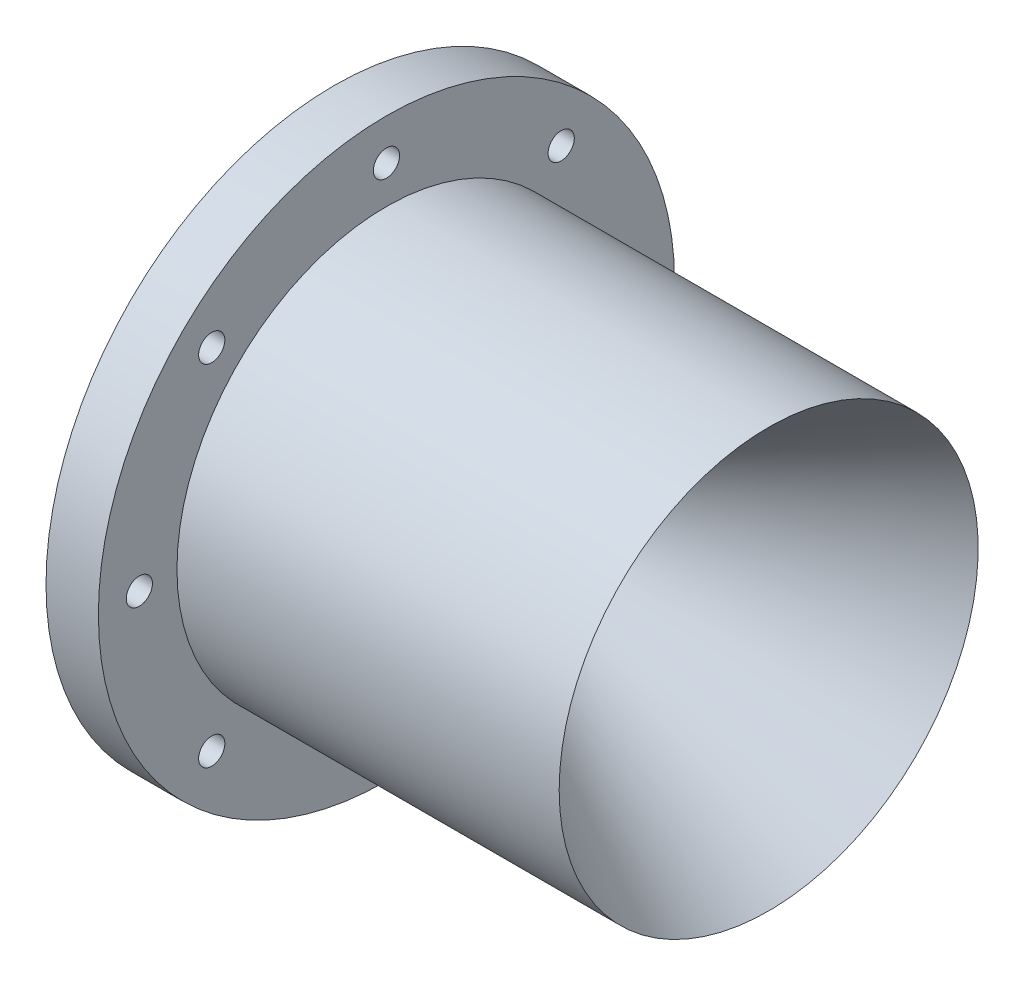
ISO-10303-21;
HEADER;
FILE_DESCRIPTION(('STEP AP214'),'2;1');
FILE_NAME('part.step','',(''),(''),'','','');
FILE_SCHEMA(('AUTOMOTIVE_DESIGN { 1 0 10303 214 1 1 1 1 }'));
ENDSEC;
DATA;
#1=APPLICATION_CONTEXT('core data for automotive mechanical design processes');
#2=APPLICATION_PROTOCOL_DEFINITION('international standard','automotive_design',2000,#1);
#3=PRODUCT_CONTEXT('',#1,'mechanical');
#4=PRODUCT('Part','Part','',(#3));
#5=PRODUCT_RELATED_PRODUCT_CATEGORY('part','',(#4));
#6=PRODUCT_DEFINITION_FORMATION('','',#4);
#7=PRODUCT_DEFINITION_CONTEXT('part definition',#1,'design');
#8=PRODUCT_DEFINITION('design','',#6,#7);
#9=PRODUCT_DEFINITION_SHAPE('','',#8);
#10=(LENGTH_UNIT() NAMED_UNIT(*) SI_UNIT(.MILLI.,.METRE.));
#11=(NAMED_UNIT(*) PLANE_ANGLE_UNIT() SI_UNIT($,.RADIAN.));
#12=(NAMED_UNIT(*) SI_UNIT($,.STERADIAN.) SOLID_ANGLE_UNIT());
#13=UNCERTAINTY_MEASURE_WITH_UNIT(LENGTH_MEASURE(1.E-05),#10,'distance_accuracy_value','');
#14=(GEOMETRIC_REPRESENTATION_CONTEXT(3) GLOBAL_UNCERTAINTY_ASSIGNED_CONTEXT((#13)) GLOBAL_UNIT_ASSIGNED_CONTEXT((#10,
#11,#12)) REPRESENTATION_CONTEXT('',''));
#15=CARTESIAN_POINT('',(0.,0.,0.));
#16=DIRECTION('',(0.,0.,1.));
#17=DIRECTION('',(1.,0.,0.));
#18=AXIS2_PLACEMENT_3D('',#15,#16,#17);
#19=CARTESIAN_POINT('',(0.,0.,0.));
#20=DIRECTION('',(-1.,0.,0.));
#21=DIRECTION('',(0.,0.,1.));
#22=AXIS2_PLACEMENT_3D('',#19,#20,#21);
#23=CYLINDRICAL_SURFACE('',#22,7.9375);
#24=CARTESIAN_POINT('',(0.,0.,0.));
#25=DIRECTION('',(-1.,0.,0.));
#26=DIRECTION('',(0.,0.,1.));
#27=AXIS2_PLACEMENT_3D('',#24,#25,#26);
#28=CIRCLE('',#27,7.9375);
#29=CARTESIAN_POINT('',(0.,0.,7.9375));
#30=VERTEX_POINT('',#29);
#31=EDGE_CURVE('E10',#30,#30,#28,.T.);
#32=ORIENTED_EDGE('',*,*,#31,.F.);
#33=EDGE_LOOP('',(#32));
#34=FACE_BOUND('',#33,.T.);
#35=CARTESIAN_POINT('',(-12.7,0.,0.));
#36=DIRECTION('',(-1.,0.,0.));
#37=DIRECTION('',(0.,0.,1.));
#38=AXIS2_PLACEMENT_3D('',#35,#36,#37);
#39=CIRCLE('',#38,7.9375);
#40=CARTESIAN_POINT('',(-12.7,0.,7.9375));
#41=VERTEX_POINT('',#40);
#42=EDGE_CURVE('E57',#41,#41,#39,.T.);
#43=ORIENTED_EDGE('',*,*,#42,.T.);
#44=EDGE_LOOP('',(#43));
#45=FACE_BOUND('',#44,.T.);
#46=ADVANCED_FACE('F32',(#34,#45),#23,.F.);
#47=CARTESIAN_POINT('',(0.,0.,0.));
#48=DIRECTION('',(1.,0.,0.));
#49=DIRECTION('',(0.,0.,-1.));
#50=AXIS2_PLACEMENT_3D('',#47,#48,#49);
#51=CONICAL_SURFACE('',#50,7.9375,0.534993353531431);
#52=CARTESIAN_POINT('',(72.3241560558228,0.,0.));
#53=DIRECTION('',(-1.,0.,0.));
#54=DIRECTION('',(0.,0.,1.));
#55=AXIS2_PLACEMENT_3D('',#52,#53,#54);
#56=CIRCLE('',#55,50.8);
#57=CARTESIAN_POINT('',(72.3241560558228,0.,50.8));
#58=VERTEX_POINT('',#57);
#59=EDGE_CURVE('E38',#58,#58,#56,.T.);
#60=ORIENTED_EDGE('',*,*,#59,.F.);
#61=EDGE_LOOP('',(#60));
#62=FACE_BOUND('',#61,.T.);
#63=ORIENTED_EDGE('',*,*,#31,.T.);
#64=EDGE_LOOP('',(#63));
#65=FACE_BOUND('',#64,.T.);
#66=ADVANCED_FACE('F150',(#62,#65),#51,.F.);
#67=CARTESIAN_POINT('',(0.,0.,0.));
#68=DIRECTION('',(-1.,0.,0.));
#69=DIRECTION('',(0.,0.,1.));
#70=AXIS2_PLACEMENT_3D('',#67,#68,#69);
#71=CYLINDRICAL_SURFACE('',#70,50.8);
#72=CARTESIAN_POINT('',(-20.3472668619156,0.,0.));
#73=DIRECTION('',(-1.,0.,0.));
#74=DIRECTION('',(0.,0.,1.));
#75=AXIS2_PLACEMENT_3D('',#72,#73,#74);
#76=CIRCLE('',#75,50.8);
#77=CARTESIAN_POINT('',(-20.3472668619156,0.,50.8));
#78=VERTEX_POINT('',#77);
#79=EDGE_CURVE('E42',#78,#78,#76,.T.);
#80=ORIENTED_EDGE('',*,*,#79,.F.);
#81=EDGE_LOOP('',(#80));
#82=FACE_BOUND('',#81,.T.);
#83=ORIENTED_EDGE('',*,*,#59,.T.);
#84=EDGE_LOOP('',(#83));
#85=FACE_BOUND('',#84,.T.);
#86=ADVANCED_FACE('F144',(#82,#85),#71,.T.);
#87=CARTESIAN_POINT('',(-20.3472668619156,69.85,0.));
#88=DIRECTION('',(-1.,0.,0.));
#89=DIRECTION('',(0.,0.,1.));
#90=AXIS2_PLACEMENT_3D('',#87,#88,#89);
#91=PLANE('',#90);
#92=CARTESIAN_POINT('',(-20.3472668619156,59.9186,0.));
#93=DIRECTION('',(-1.,0.,0.));
#94=DIRECTION('',(0.,0.,1.));
#95=AXIS2_PLACEMENT_3D('',#92,#93,#94);
#96=CIRCLE('',#95,3.175);
#97=CARTESIAN_POINT('',(-20.3472668619156,59.9186,3.175));
#98=VERTEX_POINT('',#97);
#99=EDGE_CURVE('E60',#98,#98,#96,.F.);
#100=ORIENTED_EDGE('',*,*,#99,.F.);
#101=EDGE_LOOP('',(#100));
#102=FACE_BOUND('',#101,.T.);
#103=CARTESIAN_POINT('',(-20.3472668619156,42.3688483792054,42.3688483792047));
#104=DIRECTION('',(-1.,0.,0.));
#105=DIRECTION('',(0.,0.,1.));
#106=AXIS2_PLACEMENT_3D('',#103,#104,#105);
#107=CIRCLE('',#106,3.17500000000024);
#108=CARTESIAN_POINT('',(-20.3472668619156,42.3688483792054,45.543848379205));
#109=VERTEX_POINT('',#108);
#110=EDGE_CURVE('E98',#109,#109,#107,.F.);
#111=ORIENTED_EDGE('',*,*,#110,.F.);
#112=EDGE_LOOP('',(#111));
#113=FACE_BOUND('',#112,.T.);
#114=CARTESIAN_POINT('',(-20.3472668619156,1.61747136534687E-12,59.9186000000016));
#115=DIRECTION('',(-1.,0.,0.));
#116=DIRECTION('',(0.,0.,1.));
#117=AXIS2_PLACEMENT_3D('',#114,#115,#116);
#118=CIRCLE('',#117,3.175);
#119=CARTESIAN_POINT('',(-20.3472668619156,1.61747136534687E-12,63.0936000000016));
#120=VERTEX_POINT('',#119);
#121=EDGE_CURVE('E92',#120,#120,#118,.F.);
#122=ORIENTED_EDGE('',*,*,#121,.F.);
#123=EDGE_LOOP('',(#122));
#124=FACE_BOUND('',#123,.T.);
#125=CARTESIAN_POINT('',(-20.3472668619156,-42.3688483792031,42.368848379207));
#126=DIRECTION('',(-1.,0.,0.));
#127=DIRECTION('',(0.,0.,1.));
#128=AXIS2_PLACEMENT_3D('',#125,#126,#127);
#129=CIRCLE('',#128,3.175);
#130=CARTESIAN_POINT('',(-20.3472668619156,-42.3688483792031,45.543848379207));
#131=VERTEX_POINT('',#130);
#132=EDGE_CURVE('E86',#131,#131,#129,.F.);
#133=ORIENTED_EDGE('',*,*,#132,.F.);
#134=EDGE_LOOP('',(#133));
#135=FACE_BOUND('',#134,.T.);
#136=CARTESIAN_POINT('',(-20.3472668619156,-59.9186,3.23494273069374E-12));
#137=DIRECTION('',(-1.,0.,0.));
#138=DIRECTION('',(0.,0.,1.));
#139=AXIS2_PLACEMENT_3D('',#136,#137,#138);
#140=CIRCLE('',#139,3.175);
#141=CARTESIAN_POINT('',(-20.3472668619156,-59.9186,3.17500000000323));
#142=VERTEX_POINT('',#141);
#143=EDGE_CURVE('E80',#142,#142,#140,.F.);
#144=ORIENTED_EDGE('',*,*,#143,.F.);
#145=EDGE_LOOP('',(#144));
#146=FACE_BOUND('',#145,.T.);
#147=CARTESIAN_POINT('',(-20.3472668619156,-42.3688483792054,-42.3688483792015));
#148=DIRECTION('',(-1.,0.,0.));
#149=DIRECTION('',(0.,0.,1.));
#150=AXIS2_PLACEMENT_3D('',#147,#148,#149);
#151=CIRCLE('',#150,3.175);
#152=CARTESIAN_POINT('',(-20.3472668619156,-42.3688483792054,-39.1938483792015));
#153=VERTEX_POINT('',#152);
#154=EDGE_CURVE('E74',#153,#153,#151,.F.);
#155=ORIENTED_EDGE('',*,*,#154,.F.);
#156=EDGE_LOOP('',(#155));
#157=FACE_BOUND('',#156,.T.);
#158=CARTESIAN_POINT('',(-20.3472668619156,-1.62480927751681E-12,-59.9185999999984));
#159=DIRECTION('',(-1.,0.,0.));
#160=DIRECTION('',(0.,0.,1.));
#161=AXIS2_PLACEMENT_3D('',#158,#159,#160);
#162=CIRCLE('',#161,3.175);
#163=CARTESIAN_POINT('',(-20.3472668619156,-1.62480927751681E-12,-56.7435999999984));
#164=VERTEX_POINT('',#163);
#165=EDGE_CURVE('E68',#164,#164,#162,.F.);
#166=ORIENTED_EDGE('',*,*,#165,.F.);
#167=EDGE_LOOP('',(#166));
#168=FACE_BOUND('',#167,.T.);
#169=CARTESIAN_POINT('',(-20.3472668619156,42.3688483792031,-42.3688483792038));
#170=DIRECTION('',(-1.,0.,0.));
#171=DIRECTION('',(0.,0.,1.));
#172=AXIS2_PLACEMENT_3D('',#169,#170,#171);
#173=CIRCLE('',#172,3.175);
#174=CARTESIAN_POINT('',(-20.3472668619156,42.3688483792031,-39.1938483792038));
#175=VERTEX_POINT('',#174);
#176=EDGE_CURVE('E61',#175,#175,#173,.F.);
#177=ORIENTED_EDGE('',*,*,#176,.F.);
#178=EDGE_LOOP('',(#177));
#179=FACE_BOUND('',#178,.T.);
#180=CARTESIAN_POINT('',(-20.3472668619156,0.,0.));
#181=DIRECTION('',(-1.,0.,0.));
#182=DIRECTION('',(0.,0.,1.));
#183=AXIS2_PLACEMENT_3D('',#180,#181,#182);
#184=CIRCLE('',#183,69.85);
#185=CARTESIAN_POINT('',(-20.3472668619156,0.,69.85));
#186=VERTEX_POINT('',#185);
#187=EDGE_CURVE('E46',#186,#186,#184,.T.);
#188=ORIENTED_EDGE('',*,*,#187,.F.);
#189=EDGE_LOOP('',(#188));
#190=FACE_BOUND('',#189,.T.);
#191=ORIENTED_EDGE('',*,*,#79,.T.);
#192=EDGE_LOOP('',(#191));
#193=FACE_BOUND('',#192,.T.);
#194=ADVANCED_FACE('F138',(#102,#113,#124,#135,#146,#157,#168,#179,#190,#193),#91,.F.);
#195=CARTESIAN_POINT('',(0.,0.,0.));
#196=DIRECTION('',(-1.,0.,0.));
#197=DIRECTION('',(0.,0.,1.));
#198=AXIS2_PLACEMENT_3D('',#195,#196,#197);
#199=CYLINDRICAL_SURFACE('',#198,69.85);
#200=CARTESIAN_POINT('',(-33.0472668619156,0.,0.));
#201=DIRECTION('',(-1.,0.,0.));
#202=DIRECTION('',(0.,0.,1.));
#203=AXIS2_PLACEMENT_3D('',#200,#201,#202);
#204=CIRCLE('',#203,69.85);
#205=CARTESIAN_POINT('',(-33.0472668619156,0.,69.85));
#206=VERTEX_POINT('',#205);
#207=EDGE_CURVE('E51',#206,#206,#204,.T.);
#208=ORIENTED_EDGE('',*,*,#207,.F.);
#209=EDGE_LOOP('',(#208));
#210=FACE_BOUND('',#209,.T.);
#211=ORIENTED_EDGE('',*,*,#187,.T.);
#212=EDGE_LOOP('',(#211));
#213=FACE_BOUND('',#212,.T.);
#214=ADVANCED_FACE('F116',(#210,#213),#199,.T.);
#215=CARTESIAN_POINT('',(-33.0472668619156,50.8,0.));
#216=DIRECTION('',(1.,0.,0.));
#217=DIRECTION('',(0.,0.,-1.));
#218=AXIS2_PLACEMENT_3D('',#215,#216,#217);
#219=PLANE('',#218);
#220=CARTESIAN_POINT('',(-33.0472668619156,59.9186,0.));
#221=DIRECTION('',(-1.,0.,0.));
#222=DIRECTION('',(0.,0.,1.));
#223=AXIS2_PLACEMENT_3D('',#220,#221,#222);
#224=CIRCLE('',#223,3.175);
#225=CARTESIAN_POINT('',(-33.0472668619156,59.9186,3.175));
#226=VERTEX_POINT('',#225);
#227=EDGE_CURVE('E101',#226,#226,#224,.T.);
#228=ORIENTED_EDGE('',*,*,#227,.F.);
#229=EDGE_LOOP('',(#228));
#230=FACE_BOUND('',#229,.T.);
#231=CARTESIAN_POINT('',(-33.0472668619156,42.3688483792054,42.3688483792047));
#232=DIRECTION('',(-1.,0.,0.));
#233=DIRECTION('',(0.,0.,1.));
#234=AXIS2_PLACEMENT_3D('',#231,#232,#233);
#235=CIRCLE('',#234,3.17500000000024);
#236=CARTESIAN_POINT('',(-33.0472668619156,42.3688483792054,45.543848379205));
#237=VERTEX_POINT('',#236);
#238=EDGE_CURVE('E95',#237,#237,#235,.T.);
#239=ORIENTED_EDGE('',*,*,#238,.F.);
#240=EDGE_LOOP('',(#239));
#241=FACE_BOUND('',#240,.T.);
#242=CARTESIAN_POINT('',(-33.0472668619156,1.61747136534687E-12,59.9186000000016));
#243=DIRECTION('',(-1.,0.,0.));
#244=DIRECTION('',(0.,0.,1.));
#245=AXIS2_PLACEMENT_3D('',#242,#243,#244);
#246=CIRCLE('',#245,3.175);
#247=CARTESIAN_POINT('',(-33.0472668619156,1.61747136534687E-12,63.0936000000016));
#248=VERTEX_POINT('',#247);
#249=EDGE_CURVE('E89',#248,#248,#246,.T.);
#250=ORIENTED_EDGE('',*,*,#249,.F.);
#251=EDGE_LOOP('',(#250));
#252=FACE_BOUND('',#251,.T.);
#253=CARTESIAN_POINT('',(-33.0472668619156,-42.3688483792031,42.368848379207));
#254=DIRECTION('',(-1.,0.,0.));
#255=DIRECTION('',(0.,0.,1.));
#256=AXIS2_PLACEMENT_3D('',#253,#254,#255);
#257=CIRCLE('',#256,3.175);
#258=CARTESIAN_POINT('',(-33.0472668619156,-42.3688483792031,45.543848379207));
#259=VERTEX_POINT('',#258);
#260=EDGE_CURVE('E83',#259,#259,#257,.T.);
#261=ORIENTED_EDGE('',*,*,#260,.F.);
#262=EDGE_LOOP('',(#261));
#263=FACE_BOUND('',#262,.T.);
#264=CARTESIAN_POINT('',(-33.0472668619156,-59.9186,3.23494273069374E-12));
#265=DIRECTION('',(-1.,0.,0.));
#266=DIRECTION('',(0.,0.,1.));
#267=AXIS2_PLACEMENT_3D('',#264,#265,#266);
#268=CIRCLE('',#267,3.175);
#269=CARTESIAN_POINT('',(-33.0472668619156,-59.9186,3.17500000000323));
#270=VERTEX_POINT('',#269);
#271=EDGE_CURVE('E77',#270,#270,#268,.T.);
#272=ORIENTED_EDGE('',*,*,#271,.F.);
#273=EDGE_LOOP('',(#272));
#274=FACE_BOUND('',#273,.T.);
#275=CARTESIAN_POINT('',(-33.0472668619156,-42.3688483792054,-42.3688483792015));
#276=DIRECTION('',(-1.,0.,0.));
#277=DIRECTION('',(0.,0.,1.));
#278=AXIS2_PLACEMENT_3D('',#275,#276,#277);
#279=CIRCLE('',#278,3.175);
#280=CARTESIAN_POINT('',(-33.0472668619156,-42.3688483792054,-39.1938483792015));
#281=VERTEX_POINT('',#280);
#282=EDGE_CURVE('E71',#281,#281,#279,.T.);
#283=ORIENTED_EDGE('',*,*,#282,.F.);
#284=EDGE_LOOP('',(#283));
#285=FACE_BOUND('',#284,.T.);
#286=CARTESIAN_POINT('',(-33.0472668619156,-1.62480927751681E-12,-59.9185999999984));
#287=DIRECTION('',(-1.,0.,0.));
#288=DIRECTION('',(0.,0.,1.));
#289=AXIS2_PLACEMENT_3D('',#286,#287,#288);
#290=CIRCLE('',#289,3.175);
#291=CARTESIAN_POINT('',(-33.0472668619156,-1.62480927751681E-12,-56.7435999999984));
#292=VERTEX_POINT('',#291);
#293=EDGE_CURVE('E64',#292,#292,#290,.T.);
#294=ORIENTED_EDGE('',*,*,#293,.F.);
#295=EDGE_LOOP('',(#294));
#296=FACE_BOUND('',#295,.T.);
#297=CARTESIAN_POINT('',(-33.0472668619156,42.3688483792031,-42.3688483792038));
#298=DIRECTION('',(-1.,0.,0.));
#299=DIRECTION('',(0.,0.,1.));
#300=AXIS2_PLACEMENT_3D('',#297,#298,#299);
#301=CIRCLE('',#300,3.175);
#302=CARTESIAN_POINT('',(-33.0472668619156,42.3688483792031,-39.1938483792038));
#303=VERTEX_POINT('',#302);
#304=EDGE_CURVE('E65',#303,#303,#301,.T.);
#305=ORIENTED_EDGE('',*,*,#304,.F.);
#306=EDGE_LOOP('',(#305));
#307=FACE_BOUND('',#306,.T.);
#308=CARTESIAN_POINT('',(-33.0472668619156,0.,0.));
#309=DIRECTION('',(-1.,0.,0.));
#310=DIRECTION('',(0.,0.,1.));
#311=AXIS2_PLACEMENT_3D('',#308,#309,#310);
#312=CIRCLE('',#311,41.275);
#313=CARTESIAN_POINT('',(-33.0472668619156,0.,41.275));
#314=VERTEX_POINT('',#313);
#315=EDGE_CURVE('E54',#314,#314,#312,.T.);
#316=ORIENTED_EDGE('',*,*,#315,.F.);
#317=EDGE_LOOP('',(#316));
#318=FACE_BOUND('',#317,.T.);
#319=ORIENTED_EDGE('',*,*,#207,.T.);
#320=EDGE_LOOP('',(#319));
#321=FACE_BOUND('',#320,.T.);
#322=ADVANCED_FACE('F112',(#230,#241,#252,#263,#274,#285,#296,#307,#318,#321),#219,.F.);
#323=CARTESIAN_POINT('',(-33.0472668619156,0.,0.));
#324=DIRECTION('',(-1.,0.,0.));
#325=DIRECTION('',(0.,0.,1.));
#326=AXIS2_PLACEMENT_3D('',#323,#324,#325);
#327=CONICAL_SURFACE('',#326,41.275,1.02280730700641);
#328=ORIENTED_EDGE('',*,*,#42,.F.);
#329=EDGE_LOOP('',(#328));
#330=FACE_BOUND('',#329,.T.);
#331=ORIENTED_EDGE('',*,*,#315,.T.);
#332=EDGE_LOOP('',(#331));
#333=FACE_BOUND('',#332,.T.);
#334=ADVANCED_FACE('F115',(#330,#333),#327,.F.);
#335=CARTESIAN_POINT('',(72.3251560558228,42.3688483792031,-42.3688483792038));
#336=DIRECTION('',(-1.,0.,0.));
#337=DIRECTION('',(0.,0.,1.));
#338=AXIS2_PLACEMENT_3D('',#335,#336,#337);
#339=CYLINDRICAL_SURFACE('',#338,3.175);
#340=ORIENTED_EDGE('',*,*,#304,.T.);
#341=EDGE_LOOP('',(#340));
#342=FACE_BOUND('',#341,.T.);
#343=ORIENTED_EDGE('',*,*,#176,.T.);
#344=EDGE_LOOP('',(#343));
#345=FACE_BOUND('',#344,.T.);
#346=ADVANCED_FACE('F165',(#342,#345),#339,.F.);
#347=CARTESIAN_POINT('',(72.3251560558228,-1.62480927751681E-12,-59.9185999999984));
#348=DIRECTION('',(-1.,0.,0.));
#349=DIRECTION('',(0.,0.,1.));
#350=AXIS2_PLACEMENT_3D('',#347,#348,#349);
#351=CYLINDRICAL_SURFACE('',#350,3.175);
#352=ORIENTED_EDGE('',*,*,#293,.T.);
#353=EDGE_LOOP('',(#352));
#354=FACE_BOUND('',#353,.T.);
#355=ORIENTED_EDGE('',*,*,#165,.T.);
#356=EDGE_LOOP('',(#355));
#357=FACE_BOUND('',#356,.T.);
#358=ADVANCED_FACE('F170',(#354,#357),#351,.F.);
#359=CARTESIAN_POINT('',(72.3251560558228,-42.3688483792054,-42.3688483792015));
#360=DIRECTION('',(-1.,0.,0.));
#361=DIRECTION('',(0.,0.,1.));
#362=AXIS2_PLACEMENT_3D('',#359,#360,#361);
#363=CYLINDRICAL_SURFACE('',#362,3.175);
#364=ORIENTED_EDGE('',*,*,#282,.T.);
#365=EDGE_LOOP('',(#364));
#366=FACE_BOUND('',#365,.T.);
#367=ORIENTED_EDGE('',*,*,#154,.T.);
#368=EDGE_LOOP('',(#367));
#369=FACE_BOUND('',#368,.T.);
#370=ADVANCED_FACE('F176',(#366,#369),#363,.F.);
#371=CARTESIAN_POINT('',(72.3251560558228,-59.9186,3.23494273069374E-12));
#372=DIRECTION('',(-1.,0.,0.));
#373=DIRECTION('',(0.,0.,1.));
#374=AXIS2_PLACEMENT_3D('',#371,#372,#373);
#375=CYLINDRICAL_SURFACE('',#374,3.175);
#376=ORIENTED_EDGE('',*,*,#271,.T.);
#377=EDGE_LOOP('',(#376));
#378=FACE_BOUND('',#377,.T.);
#379=ORIENTED_EDGE('',*,*,#143,.T.);
#380=EDGE_LOOP('',(#379));
#381=FACE_BOUND('',#380,.T.);
#382=ADVANCED_FACE('F180',(#378,#381),#375,.F.);
#383=CARTESIAN_POINT('',(72.3251560558228,-42.3688483792031,42.368848379207));
#384=DIRECTION('',(-1.,0.,0.));
#385=DIRECTION('',(0.,0.,1.));
#386=AXIS2_PLACEMENT_3D('',#383,#384,#385);
#387=CYLINDRICAL_SURFACE('',#386,3.175);
#388=ORIENTED_EDGE('',*,*,#260,.T.);
#389=EDGE_LOOP('',(#388));
#390=FACE_BOUND('',#389,.T.);
#391=ORIENTED_EDGE('',*,*,#132,.T.);
#392=EDGE_LOOP('',(#391));
#393=FACE_BOUND('',#392,.T.);
#394=ADVANCED_FACE('F184',(#390,#393),#387,.F.);
#395=CARTESIAN_POINT('',(72.3251560558228,1.61747136534687E-12,59.9186000000016));
#396=DIRECTION('',(-1.,0.,0.));
#397=DIRECTION('',(0.,0.,1.));
#398=AXIS2_PLACEMENT_3D('',#395,#396,#397);
#399=CYLINDRICAL_SURFACE('',#398,3.175);
#400=ORIENTED_EDGE('',*,*,#249,.T.);
#401=EDGE_LOOP('',(#400));
#402=FACE_BOUND('',#401,.T.);
#403=ORIENTED_EDGE('',*,*,#121,.T.);
#404=EDGE_LOOP('',(#403));
#405=FACE_BOUND('',#404,.T.);
#406=ADVANCED_FACE('F188',(#402,#405),#399,.F.);
#407=CARTESIAN_POINT('',(72.3251560558228,42.3688483792054,42.3688483792047));
#408=DIRECTION('',(-1.,0.,0.));
#409=DIRECTION('',(0.,0.,1.));
#410=AXIS2_PLACEMENT_3D('',#407,#408,#409);
#411=CYLINDRICAL_SURFACE('',#410,3.17500000000024);
#412=ORIENTED_EDGE('',*,*,#238,.T.);
#413=EDGE_LOOP('',(#412));
#414=FACE_BOUND('',#413,.T.);
#415=ORIENTED_EDGE('',*,*,#110,.T.);
#416=EDGE_LOOP('',(#415));
#417=FACE_BOUND('',#416,.T.);
#418=ADVANCED_FACE('F192',(#414,#417),#411,.F.);
#419=CARTESIAN_POINT('',(72.3251560558228,59.9186,0.));
#420=DIRECTION('',(-1.,0.,0.));
#421=DIRECTION('',(0.,0.,1.));
#422=AXIS2_PLACEMENT_3D('',#419,#420,#421);
#423=CYLINDRICAL_SURFACE('',#422,3.175);
#424=ORIENTED_EDGE('',*,*,#227,.T.);
#425=EDGE_LOOP('',(#424));
#426=FACE_BOUND('',#425,.T.);
#427=ORIENTED_EDGE('',*,*,#99,.T.);
#428=EDGE_LOOP('',(#427));
#429=FACE_BOUND('',#428,.T.);
#430=ADVANCED_FACE('F109',(#426,#429),#423,.F.);
#431=CLOSED_SHELL('',(#46,#66,#86,#194,#214,#322,#334,#346,#358,#370,#382,#394,#406,#418,#430));
#432=MANIFOLD_SOLID_BREP('B2',#431);
#433=ADVANCED_BREP_SHAPE_REPRESENTATION('',(#18,#432),#14);
#434=SHAPE_DEFINITION_REPRESENTATION(#9,#433);
ENDSEC;
END-ISO-10303-21;
